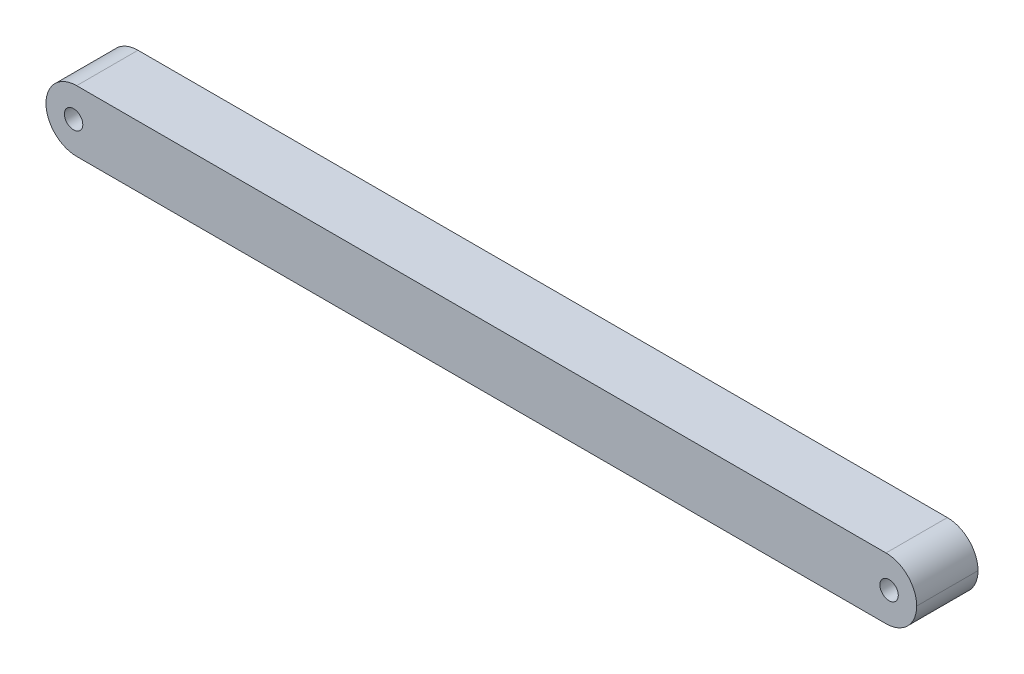
ISO-10303-21;
HEADER;
FILE_DESCRIPTION(('STEP AP214'),'2;1');
FILE_NAME('part.step','',(''),(''),'','','');
FILE_SCHEMA(('AUTOMOTIVE_DESIGN { 1 0 10303 214 1 1 1 1 }'));
ENDSEC;
DATA;
#1=APPLICATION_CONTEXT('core data for automotive mechanical design processes');
#2=APPLICATION_PROTOCOL_DEFINITION('international standard','automotive_design',2000,#1);
#3=PRODUCT_CONTEXT('',#1,'mechanical');
#4=PRODUCT('Part','Part','',(#3));
#5=PRODUCT_RELATED_PRODUCT_CATEGORY('part','',(#4));
#6=PRODUCT_DEFINITION_FORMATION('','',#4);
#7=PRODUCT_DEFINITION_CONTEXT('part definition',#1,'design');
#8=PRODUCT_DEFINITION('design','',#6,#7);
#9=PRODUCT_DEFINITION_SHAPE('','',#8);
#10=(LENGTH_UNIT() NAMED_UNIT(*) SI_UNIT(.MILLI.,.METRE.));
#11=(NAMED_UNIT(*) PLANE_ANGLE_UNIT() SI_UNIT($,.RADIAN.));
#12=(NAMED_UNIT(*) SI_UNIT($,.STERADIAN.) SOLID_ANGLE_UNIT());
#13=UNCERTAINTY_MEASURE_WITH_UNIT(LENGTH_MEASURE(1.E-05),#10,'distance_accuracy_value','');
#14=(GEOMETRIC_REPRESENTATION_CONTEXT(3) GLOBAL_UNCERTAINTY_ASSIGNED_CONTEXT((#13)) GLOBAL_UNIT_ASSIGNED_CONTEXT((#10,
#11,#12)) REPRESENTATION_CONTEXT('',''));
#15=CARTESIAN_POINT('',(0.,0.,0.));
#16=DIRECTION('',(0.,0.,1.));
#17=DIRECTION('',(1.,0.,0.));
#18=AXIS2_PLACEMENT_3D('',#15,#16,#17);
#19=CARTESIAN_POINT('',(137.,5.,10.));
#20=DIRECTION('',(0.,0.,1.));
#21=DIRECTION('',(1.,0.,0.));
#22=AXIS2_PLACEMENT_3D('',#19,#20,#21);
#23=CYLINDRICAL_SURFACE('',#22,5.);
#24=DIRECTION('',(0.,0.,1.));
#25=VECTOR('',#24,1.);
#26=CARTESIAN_POINT('',(137.,0.,10.));
#27=LINE('',#26,#25);
#28=CARTESIAN_POINT('',(137.,0.,0.));
#29=VERTEX_POINT('',#28);
#30=CARTESIAN_POINT('',(137.,0.,10.));
#31=VERTEX_POINT('',#30);
#32=EDGE_CURVE('E163',#29,#31,#27,.T.);
#33=ORIENTED_EDGE('',*,*,#32,.F.);
#34=CARTESIAN_POINT('',(137.,5.,0.));
#35=DIRECTION('',(0.,0.,1.));
#36=DIRECTION('',(1.,0.,0.));
#37=AXIS2_PLACEMENT_3D('',#34,#35,#36);
#38=CIRCLE('',#37,5.);
#39=CARTESIAN_POINT('',(142.,5.,0.));
#40=VERTEX_POINT('',#39);
#41=EDGE_CURVE('E55',#40,#29,#38,.F.);
#42=ORIENTED_EDGE('',*,*,#41,.F.);
#43=DIRECTION('',(0.,0.,-1.));
#44=VECTOR('',#43,1.);
#45=CARTESIAN_POINT('',(142.,5.,10.));
#46=LINE('',#45,#44);
#47=CARTESIAN_POINT('',(142.,5.,10.));
#48=VERTEX_POINT('',#47);
#49=EDGE_CURVE('E154',#40,#48,#46,.F.);
#50=ORIENTED_EDGE('',*,*,#49,.T.);
#51=CARTESIAN_POINT('',(137.,5.,10.));
#52=DIRECTION('',(0.,0.,1.));
#53=DIRECTION('',(1.,0.,0.));
#54=AXIS2_PLACEMENT_3D('',#51,#52,#53);
#55=CIRCLE('',#54,5.);
#56=EDGE_CURVE('E11',#31,#48,#55,.T.);
#57=ORIENTED_EDGE('',*,*,#56,.F.);
#58=EDGE_LOOP('',(#33,#42,#50,#57));
#59=FACE_BOUND('',#58,.T.);
#60=ADVANCED_FACE('F47',(#59),#23,.T.);
#61=CARTESIAN_POINT('',(137.,5.,10.));
#62=DIRECTION('',(0.,0.,1.));
#63=DIRECTION('',(1.,0.,0.));
#64=AXIS2_PLACEMENT_3D('',#61,#62,#63);
#65=CYLINDRICAL_SURFACE('',#64,5.);
#66=DIRECTION('',(0.,0.,-1.));
#67=VECTOR('',#66,1.);
#68=CARTESIAN_POINT('',(137.,10.,10.));
#69=LINE('',#68,#67);
#70=CARTESIAN_POINT('',(137.,10.,10.));
#71=VERTEX_POINT('',#70);
#72=CARTESIAN_POINT('',(137.,10.,0.));
#73=VERTEX_POINT('',#72);
#74=EDGE_CURVE('E124',#71,#73,#69,.T.);
#75=ORIENTED_EDGE('',*,*,#74,.F.);
#76=CARTESIAN_POINT('',(137.,5.,10.));
#77=DIRECTION('',(0.,0.,1.));
#78=DIRECTION('',(1.,0.,0.));
#79=AXIS2_PLACEMENT_3D('',#76,#77,#78);
#80=CIRCLE('',#79,5.);
#81=EDGE_CURVE('E157',#48,#71,#80,.T.);
#82=ORIENTED_EDGE('',*,*,#81,.F.);
#83=ORIENTED_EDGE('',*,*,#49,.F.);
#84=CARTESIAN_POINT('',(137.,5.,0.));
#85=DIRECTION('',(0.,0.,1.));
#86=DIRECTION('',(1.,0.,0.));
#87=AXIS2_PLACEMENT_3D('',#84,#85,#86);
#88=CIRCLE('',#87,5.);
#89=EDGE_CURVE('E160',#73,#40,#88,.F.);
#90=ORIENTED_EDGE('',*,*,#89,.F.);
#91=EDGE_LOOP('',(#75,#82,#83,#90));
#92=FACE_BOUND('',#91,.T.);
#93=ADVANCED_FACE('F202',(#92),#65,.T.);
#94=CARTESIAN_POINT('',(5.,5.,10.));
#95=DIRECTION('',(0.,0.,1.));
#96=DIRECTION('',(1.,0.,0.));
#97=AXIS2_PLACEMENT_3D('',#94,#95,#96);
#98=CYLINDRICAL_SURFACE('',#97,5.);
#99=DIRECTION('',(0.,0.,-1.));
#100=VECTOR('',#99,1.);
#101=CARTESIAN_POINT('',(5.,0.,10.));
#102=LINE('',#101,#100);
#103=CARTESIAN_POINT('',(5.,0.,10.));
#104=VERTEX_POINT('',#103);
#105=CARTESIAN_POINT('',(5.,0.,0.));
#106=VERTEX_POINT('',#105);
#107=EDGE_CURVE('E143',#104,#106,#102,.T.);
#108=ORIENTED_EDGE('',*,*,#107,.F.);
#109=CARTESIAN_POINT('',(5.,5.,10.));
#110=DIRECTION('',(0.,0.,1.));
#111=DIRECTION('',(1.,0.,0.));
#112=AXIS2_PLACEMENT_3D('',#109,#110,#111);
#113=CIRCLE('',#112,5.);
#114=CARTESIAN_POINT('',(0.,5.,10.));
#115=VERTEX_POINT('',#114);
#116=EDGE_CURVE('E147',#115,#104,#113,.T.);
#117=ORIENTED_EDGE('',*,*,#116,.F.);
#118=DIRECTION('',(0.,0.,1.));
#119=VECTOR('',#118,1.);
#120=CARTESIAN_POINT('',(0.,5.,10.));
#121=LINE('',#120,#119);
#122=CARTESIAN_POINT('',(0.,5.,0.));
#123=VERTEX_POINT('',#122);
#124=EDGE_CURVE('E109',#115,#123,#121,.F.);
#125=ORIENTED_EDGE('',*,*,#124,.T.);
#126=CARTESIAN_POINT('',(5.,5.,0.));
#127=DIRECTION('',(0.,0.,1.));
#128=DIRECTION('',(1.,0.,0.));
#129=AXIS2_PLACEMENT_3D('',#126,#127,#128);
#130=CIRCLE('',#129,5.);
#131=EDGE_CURVE('E103',#106,#123,#130,.F.);
#132=ORIENTED_EDGE('',*,*,#131,.F.);
#133=EDGE_LOOP('',(#108,#117,#125,#132));
#134=FACE_BOUND('',#133,.T.);
#135=ADVANCED_FACE('F206',(#134),#98,.T.);
#136=CARTESIAN_POINT('',(5.,5.,10.));
#137=DIRECTION('',(0.,0.,1.));
#138=DIRECTION('',(1.,0.,0.));
#139=AXIS2_PLACEMENT_3D('',#136,#137,#138);
#140=CYLINDRICAL_SURFACE('',#139,5.);
#141=DIRECTION('',(0.,0.,1.));
#142=VECTOR('',#141,1.);
#143=CARTESIAN_POINT('',(5.,10.,10.));
#144=LINE('',#143,#142);
#145=CARTESIAN_POINT('',(5.,10.,0.));
#146=VERTEX_POINT('',#145);
#147=CARTESIAN_POINT('',(5.,10.,10.));
#148=VERTEX_POINT('',#147);
#149=EDGE_CURVE('E112',#146,#148,#144,.T.);
#150=ORIENTED_EDGE('',*,*,#149,.F.);
#151=CARTESIAN_POINT('',(5.,5.,0.));
#152=DIRECTION('',(0.,0.,1.));
#153=DIRECTION('',(1.,0.,0.));
#154=AXIS2_PLACEMENT_3D('',#151,#152,#153);
#155=CIRCLE('',#154,5.);
#156=EDGE_CURVE('E97',#123,#146,#155,.F.);
#157=ORIENTED_EDGE('',*,*,#156,.F.);
#158=ORIENTED_EDGE('',*,*,#124,.F.);
#159=CARTESIAN_POINT('',(5.,5.,10.));
#160=DIRECTION('',(0.,0.,1.));
#161=DIRECTION('',(1.,0.,0.));
#162=AXIS2_PLACEMENT_3D('',#159,#160,#161);
#163=CIRCLE('',#162,5.);
#164=EDGE_CURVE('E108',#148,#115,#163,.T.);
#165=ORIENTED_EDGE('',*,*,#164,.F.);
#166=EDGE_LOOP('',(#150,#157,#158,#165));
#167=FACE_BOUND('',#166,.T.);
#168=ADVANCED_FACE('F113',(#167),#140,.T.);
#169=CARTESIAN_POINT('',(0.,0.,10.));
#170=DIRECTION('',(0.,1.,0.));
#171=DIRECTION('',(0.,0.,1.));
#172=AXIS2_PLACEMENT_3D('',#169,#170,#171);
#173=PLANE('',#172);
#174=DIRECTION('',(1.,0.,0.));
#175=VECTOR('',#174,1.);
#176=CARTESIAN_POINT('',(0.,0.,0.));
#177=LINE('',#176,#175);
#178=EDGE_CURVE('E127',#106,#29,#177,.T.);
#179=ORIENTED_EDGE('',*,*,#178,.T.);
#180=ORIENTED_EDGE('',*,*,#32,.T.);
#181=DIRECTION('',(1.,0.,0.));
#182=VECTOR('',#181,1.);
#183=CARTESIAN_POINT('',(0.,0.,10.));
#184=LINE('',#183,#182);
#185=EDGE_CURVE('E172',#104,#31,#184,.T.);
#186=ORIENTED_EDGE('',*,*,#185,.F.);
#187=ORIENTED_EDGE('',*,*,#107,.T.);
#188=EDGE_LOOP('',(#179,#180,#186,#187));
#189=FACE_BOUND('',#188,.T.);
#190=ADVANCED_FACE('F197',(#189),#173,.F.);
#191=CARTESIAN_POINT('',(0.,10.,10.));
#192=DIRECTION('',(0.,1.,0.));
#193=DIRECTION('',(0.,0.,1.));
#194=AXIS2_PLACEMENT_3D('',#191,#192,#193);
#195=PLANE('',#194);
#196=DIRECTION('',(1.,0.,0.));
#197=VECTOR('',#196,1.);
#198=CARTESIAN_POINT('',(0.,10.,10.));
#199=LINE('',#198,#197);
#200=EDGE_CURVE('E169',#148,#71,#199,.T.);
#201=ORIENTED_EDGE('',*,*,#200,.T.);
#202=ORIENTED_EDGE('',*,*,#74,.T.);
#203=DIRECTION('',(1.,0.,0.));
#204=VECTOR('',#203,1.);
#205=CARTESIAN_POINT('',(0.,10.,0.));
#206=LINE('',#205,#204);
#207=EDGE_CURVE('E102',#146,#73,#206,.T.);
#208=ORIENTED_EDGE('',*,*,#207,.F.);
#209=ORIENTED_EDGE('',*,*,#149,.T.);
#210=EDGE_LOOP('',(#201,#202,#208,#209));
#211=FACE_BOUND('',#210,.T.);
#212=ADVANCED_FACE('F122',(#211),#195,.T.);
#213=CARTESIAN_POINT('',(137.5,5.,10.));
#214=DIRECTION('',(0.,0.,-1.));
#215=DIRECTION('',(-1.,0.,0.));
#216=AXIS2_PLACEMENT_3D('',#213,#214,#215);
#217=CYLINDRICAL_SURFACE('',#216,1.5);
#218=CARTESIAN_POINT('',(137.5,5.,10.));
#219=DIRECTION('',(0.,0.,1.));
#220=DIRECTION('',(1.,0.,0.));
#221=AXIS2_PLACEMENT_3D('',#218,#219,#220);
#222=CIRCLE('',#221,1.5);
#223=CARTESIAN_POINT('',(139.,5.,10.));
#224=VERTEX_POINT('',#223);
#225=EDGE_CURVE('E132',#224,#224,#222,.T.);
#226=ORIENTED_EDGE('',*,*,#225,.T.);
#227=EDGE_LOOP('',(#226));
#228=FACE_BOUND('',#227,.T.);
#229=CARTESIAN_POINT('',(137.5,5.,0.));
#230=DIRECTION('',(0.,0.,1.));
#231=DIRECTION('',(1.,0.,0.));
#232=AXIS2_PLACEMENT_3D('',#229,#230,#231);
#233=CIRCLE('',#232,1.5);
#234=CARTESIAN_POINT('',(139.,5.,0.));
#235=VERTEX_POINT('',#234);
#236=EDGE_CURVE('E135',#235,#235,#233,.T.);
#237=ORIENTED_EDGE('',*,*,#236,.F.);
#238=EDGE_LOOP('',(#237));
#239=FACE_BOUND('',#238,.T.);
#240=ADVANCED_FACE('F186',(#228,#239),#217,.F.);
#241=CARTESIAN_POINT('',(4.5,5.,10.));
#242=DIRECTION('',(0.,0.,-1.));
#243=DIRECTION('',(-1.,0.,0.));
#244=AXIS2_PLACEMENT_3D('',#241,#242,#243);
#245=CYLINDRICAL_SURFACE('',#244,1.5);
#246=CARTESIAN_POINT('',(4.5,5.,10.));
#247=DIRECTION('',(0.,0.,1.));
#248=DIRECTION('',(1.,0.,0.));
#249=AXIS2_PLACEMENT_3D('',#246,#247,#248);
#250=CIRCLE('',#249,1.5);
#251=CARTESIAN_POINT('',(6.,5.,10.));
#252=VERTEX_POINT('',#251);
#253=EDGE_CURVE('E119',#252,#252,#250,.T.);
#254=ORIENTED_EDGE('',*,*,#253,.T.);
#255=EDGE_LOOP('',(#254));
#256=FACE_BOUND('',#255,.T.);
#257=CARTESIAN_POINT('',(4.5,5.,0.));
#258=DIRECTION('',(0.,0.,1.));
#259=DIRECTION('',(1.,0.,0.));
#260=AXIS2_PLACEMENT_3D('',#257,#258,#259);
#261=CIRCLE('',#260,1.5);
#262=CARTESIAN_POINT('',(6.,5.,0.));
#263=VERTEX_POINT('',#262);
#264=EDGE_CURVE('E126',#263,#263,#261,.T.);
#265=ORIENTED_EDGE('',*,*,#264,.F.);
#266=EDGE_LOOP('',(#265));
#267=FACE_BOUND('',#266,.T.);
#268=ADVANCED_FACE('F188',(#256,#267),#245,.F.);
#269=CARTESIAN_POINT('',(0.,0.,10.));
#270=DIRECTION('',(0.,0.,1.));
#271=DIRECTION('',(1.,0.,0.));
#272=AXIS2_PLACEMENT_3D('',#269,#270,#271);
#273=PLANE('',#272);
#274=ORIENTED_EDGE('',*,*,#225,.F.);
#275=EDGE_LOOP('',(#274));
#276=FACE_BOUND('',#275,.T.);
#277=ORIENTED_EDGE('',*,*,#185,.T.);
#278=ORIENTED_EDGE('',*,*,#56,.T.);
#279=ORIENTED_EDGE('',*,*,#81,.T.);
#280=ORIENTED_EDGE('',*,*,#200,.F.);
#281=ORIENTED_EDGE('',*,*,#164,.T.);
#282=ORIENTED_EDGE('',*,*,#116,.T.);
#283=EDGE_LOOP('',(#277,#278,#279,#280,#281,#282));
#284=FACE_BOUND('',#283,.T.);
#285=ORIENTED_EDGE('',*,*,#253,.F.);
#286=EDGE_LOOP('',(#285));
#287=FACE_BOUND('',#286,.T.);
#288=ADVANCED_FACE('F194',(#276,#284,#287),#273,.T.);
#289=CARTESIAN_POINT('',(0.,0.,0.));
#290=DIRECTION('',(0.,0.,1.));
#291=DIRECTION('',(1.,0.,0.));
#292=AXIS2_PLACEMENT_3D('',#289,#290,#291);
#293=PLANE('',#292);
#294=ORIENTED_EDGE('',*,*,#236,.T.);
#295=EDGE_LOOP('',(#294));
#296=FACE_BOUND('',#295,.T.);
#297=ORIENTED_EDGE('',*,*,#89,.T.);
#298=ORIENTED_EDGE('',*,*,#41,.T.);
#299=ORIENTED_EDGE('',*,*,#178,.F.);
#300=ORIENTED_EDGE('',*,*,#131,.T.);
#301=ORIENTED_EDGE('',*,*,#156,.T.);
#302=ORIENTED_EDGE('',*,*,#207,.T.);
#303=EDGE_LOOP('',(#297,#298,#299,#300,#301,#302));
#304=FACE_BOUND('',#303,.T.);
#305=ORIENTED_EDGE('',*,*,#264,.T.);
#306=EDGE_LOOP('',(#305));
#307=FACE_BOUND('',#306,.T.);
#308=ADVANCED_FACE('F99',(#296,#304,#307),#293,.F.);
#309=CLOSED_SHELL('',(#60,#93,#135,#168,#190,#212,#240,#268,#288,#308));
#310=MANIFOLD_SOLID_BREP('B2',#309);
#311=ADVANCED_BREP_SHAPE_REPRESENTATION('',(#18,#310),#14);
#312=SHAPE_DEFINITION_REPRESENTATION(#9,#311);
ENDSEC;
END-ISO-10303-21;
